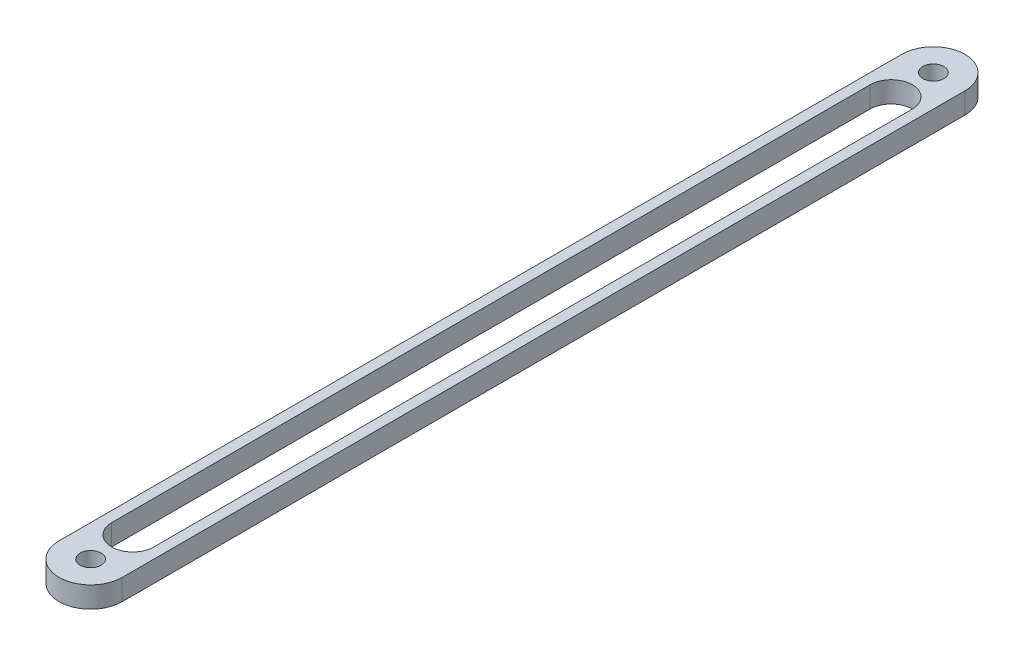
ISO-10303-21;
HEADER;
FILE_DESCRIPTION(('STEP AP214'),'2;1');
FILE_NAME('part.step','',(''),(''),'','','');
FILE_SCHEMA(('AUTOMOTIVE_DESIGN { 1 0 10303 214 1 1 1 1 }'));
ENDSEC;
DATA;
#1=APPLICATION_CONTEXT('core data for automotive mechanical design processes');
#2=APPLICATION_PROTOCOL_DEFINITION('international standard','automotive_design',2000,#1);
#3=PRODUCT_CONTEXT('',#1,'mechanical');
#4=PRODUCT('Part','Part','',(#3));
#5=PRODUCT_RELATED_PRODUCT_CATEGORY('part','',(#4));
#6=PRODUCT_DEFINITION_FORMATION('','',#4);
#7=PRODUCT_DEFINITION_CONTEXT('part definition',#1,'design');
#8=PRODUCT_DEFINITION('design','',#6,#7);
#9=PRODUCT_DEFINITION_SHAPE('','',#8);
#10=(LENGTH_UNIT() NAMED_UNIT(*) SI_UNIT(.MILLI.,.METRE.));
#11=(NAMED_UNIT(*) PLANE_ANGLE_UNIT() SI_UNIT($,.RADIAN.));
#12=(NAMED_UNIT(*) SI_UNIT($,.STERADIAN.) SOLID_ANGLE_UNIT());
#13=UNCERTAINTY_MEASURE_WITH_UNIT(LENGTH_MEASURE(1.E-05),#10,'distance_accuracy_value','');
#14=(GEOMETRIC_REPRESENTATION_CONTEXT(3) GLOBAL_UNCERTAINTY_ASSIGNED_CONTEXT((#13)) GLOBAL_UNIT_ASSIGNED_CONTEXT((#10,
#11,#12)) REPRESENTATION_CONTEXT('',''));
#15=CARTESIAN_POINT('',(0.,0.,0.));
#16=DIRECTION('',(0.,0.,1.));
#17=DIRECTION('',(1.,0.,0.));
#18=AXIS2_PLACEMENT_3D('',#15,#16,#17);
#19=CARTESIAN_POINT('',(3.75000000000001,2.5,0.));
#20=DIRECTION('',(0.,-1.,0.));
#21=DIRECTION('',(0.,0.,-1.));
#22=AXIS2_PLACEMENT_3D('',#19,#20,#21);
#23=PLANE('',#22);
#24=CARTESIAN_POINT('',(3.75000000000001,2.5,-95.));
#25=DIRECTION('',(0.,1.,0.));
#26=DIRECTION('',(0.,0.,-1.));
#27=AXIS2_PLACEMENT_3D('',#24,#25,#26);
#28=CIRCLE('',#27,2.50000000000001);
#29=CARTESIAN_POINT('',(6.25000000000001,2.5,-95.));
#30=VERTEX_POINT('',#29);
#31=CARTESIAN_POINT('',(1.25,2.5,-95.));
#32=VERTEX_POINT('',#31);
#33=EDGE_CURVE('E98',#30,#32,#28,.T.);
#34=ORIENTED_EDGE('',*,*,#33,.F.);
#35=DIRECTION('',(0.,0.,-1.));
#36=VECTOR('',#35,1.);
#37=CARTESIAN_POINT('',(6.25000000000001,2.5,-5.));
#38=LINE('',#37,#36);
#39=CARTESIAN_POINT('',(6.25000000000001,2.5,-5.));
#40=VERTEX_POINT('',#39);
#41=EDGE_CURVE('E121',#40,#30,#38,.T.);
#42=ORIENTED_EDGE('',*,*,#41,.F.);
#43=CARTESIAN_POINT('',(3.75000000000001,2.5,-5.));
#44=DIRECTION('',(0.,1.,0.));
#45=DIRECTION('',(0.,0.,1.));
#46=AXIS2_PLACEMENT_3D('',#43,#44,#45);
#47=CIRCLE('',#46,2.5);
#48=CARTESIAN_POINT('',(1.25000000000001,2.5,-5.));
#49=VERTEX_POINT('',#48);
#50=EDGE_CURVE('E119',#49,#40,#47,.T.);
#51=ORIENTED_EDGE('',*,*,#50,.F.);
#52=DIRECTION('',(0.,0.,1.));
#53=VECTOR('',#52,1.);
#54=CARTESIAN_POINT('',(1.25,2.5,-95.));
#55=LINE('',#54,#53);
#56=EDGE_CURVE('E106',#32,#49,#55,.T.);
#57=ORIENTED_EDGE('',*,*,#56,.F.);
#58=EDGE_LOOP('',(#34,#42,#51,#57));
#59=FACE_BOUND('',#58,.T.);
#60=CARTESIAN_POINT('',(3.75000000000001,2.5,0.));
#61=DIRECTION('',(0.,1.,0.));
#62=DIRECTION('',(0.,0.,-1.));
#63=AXIS2_PLACEMENT_3D('',#60,#61,#62);
#64=CIRCLE('',#63,3.75000000000001);
#65=CARTESIAN_POINT('',(0.,2.5,0.));
#66=VERTEX_POINT('',#65);
#67=CARTESIAN_POINT('',(7.50000000000001,2.5,0.));
#68=VERTEX_POINT('',#67);
#69=EDGE_CURVE('E143',#66,#68,#64,.T.);
#70=ORIENTED_EDGE('',*,*,#69,.T.);
#71=DIRECTION('',(0.,0.,-1.));
#72=VECTOR('',#71,1.);
#73=CARTESIAN_POINT('',(7.5,2.5,-100.));
#74=LINE('',#73,#72);
#75=CARTESIAN_POINT('',(7.5,2.5,-100.));
#76=VERTEX_POINT('',#75);
#77=EDGE_CURVE('E146',#68,#76,#74,.T.);
#78=ORIENTED_EDGE('',*,*,#77,.T.);
#79=CARTESIAN_POINT('',(3.75,2.5,-100.));
#80=DIRECTION('',(0.,1.,0.));
#81=DIRECTION('',(0.,0.,-1.));
#82=AXIS2_PLACEMENT_3D('',#79,#80,#81);
#83=CIRCLE('',#82,3.75);
#84=CARTESIAN_POINT('',(0.,2.5,-100.));
#85=VERTEX_POINT('',#84);
#86=EDGE_CURVE('E149',#76,#85,#83,.T.);
#87=ORIENTED_EDGE('',*,*,#86,.T.);
#88=DIRECTION('',(0.,0.,1.));
#89=VECTOR('',#88,1.);
#90=CARTESIAN_POINT('',(0.,2.5,0.));
#91=LINE('',#90,#89);
#92=EDGE_CURVE('E151',#85,#66,#91,.T.);
#93=ORIENTED_EDGE('',*,*,#92,.T.);
#94=EDGE_LOOP('',(#70,#78,#87,#93));
#95=FACE_BOUND('',#94,.T.);
#96=CARTESIAN_POINT('',(3.75000000000001,2.5,0.));
#97=DIRECTION('',(0.,1.,0.));
#98=DIRECTION('',(0.,0.,1.));
#99=AXIS2_PLACEMENT_3D('',#96,#97,#98);
#100=CIRCLE('',#99,1.25);
#101=CARTESIAN_POINT('',(3.75000000000001,2.5,1.25));
#102=VERTEX_POINT('',#101);
#103=EDGE_CURVE('E137',#102,#102,#100,.T.);
#104=ORIENTED_EDGE('',*,*,#103,.F.);
#105=EDGE_LOOP('',(#104));
#106=FACE_BOUND('',#105,.T.);
#107=CARTESIAN_POINT('',(3.75,2.5,-100.));
#108=DIRECTION('',(0.,1.,0.));
#109=DIRECTION('',(0.,0.,1.));
#110=AXIS2_PLACEMENT_3D('',#107,#108,#109);
#111=CIRCLE('',#110,1.25);
#112=CARTESIAN_POINT('',(3.75,2.5,-98.75));
#113=VERTEX_POINT('',#112);
#114=EDGE_CURVE('E127',#113,#113,#111,.T.);
#115=ORIENTED_EDGE('',*,*,#114,.F.);
#116=EDGE_LOOP('',(#115));
#117=FACE_BOUND('',#116,.T.);
#118=ADVANCED_FACE('F33',(#59,#95,#106,#117),#23,.F.);
#119=CARTESIAN_POINT('',(3.75000000000001,0.,0.));
#120=DIRECTION('',(0.,-1.,0.));
#121=DIRECTION('',(0.,0.,-1.));
#122=AXIS2_PLACEMENT_3D('',#119,#120,#121);
#123=PLANE('',#122);
#124=DIRECTION('',(0.,0.,-1.));
#125=VECTOR('',#124,1.);
#126=CARTESIAN_POINT('',(6.25000000000001,0.,-5.));
#127=LINE('',#126,#125);
#128=CARTESIAN_POINT('',(6.25000000000001,0.,-5.));
#129=VERTEX_POINT('',#128);
#130=CARTESIAN_POINT('',(6.25000000000001,0.,-95.));
#131=VERTEX_POINT('',#130);
#132=EDGE_CURVE('E107',#129,#131,#127,.T.);
#133=ORIENTED_EDGE('',*,*,#132,.T.);
#134=CARTESIAN_POINT('',(3.75000000000001,0.,-95.));
#135=DIRECTION('',(0.,1.,0.));
#136=DIRECTION('',(0.,0.,-1.));
#137=AXIS2_PLACEMENT_3D('',#134,#135,#136);
#138=CIRCLE('',#137,2.50000000000001);
#139=CARTESIAN_POINT('',(1.25,0.,-95.));
#140=VERTEX_POINT('',#139);
#141=EDGE_CURVE('E56',#131,#140,#138,.T.);
#142=ORIENTED_EDGE('',*,*,#141,.T.);
#143=DIRECTION('',(0.,0.,1.));
#144=VECTOR('',#143,1.);
#145=CARTESIAN_POINT('',(1.25,0.,-95.));
#146=LINE('',#145,#144);
#147=CARTESIAN_POINT('',(1.25000000000001,0.,-5.));
#148=VERTEX_POINT('',#147);
#149=EDGE_CURVE('E113',#140,#148,#146,.T.);
#150=ORIENTED_EDGE('',*,*,#149,.T.);
#151=CARTESIAN_POINT('',(3.75000000000001,0.,-5.));
#152=DIRECTION('',(0.,1.,0.));
#153=DIRECTION('',(0.,0.,1.));
#154=AXIS2_PLACEMENT_3D('',#151,#152,#153);
#155=CIRCLE('',#154,2.5);
#156=EDGE_CURVE('E129',#148,#129,#155,.T.);
#157=ORIENTED_EDGE('',*,*,#156,.T.);
#158=EDGE_LOOP('',(#133,#142,#150,#157));
#159=FACE_BOUND('',#158,.T.);
#160=CARTESIAN_POINT('',(3.75000000000001,0.,0.));
#161=DIRECTION('',(0.,1.,0.));
#162=DIRECTION('',(0.,0.,-1.));
#163=AXIS2_PLACEMENT_3D('',#160,#161,#162);
#164=CIRCLE('',#163,3.75000000000001);
#165=CARTESIAN_POINT('',(0.,0.,0.));
#166=VERTEX_POINT('',#165);
#167=CARTESIAN_POINT('',(7.50000000000001,0.,0.));
#168=VERTEX_POINT('',#167);
#169=EDGE_CURVE('E140',#166,#168,#164,.T.);
#170=ORIENTED_EDGE('',*,*,#169,.F.);
#171=DIRECTION('',(0.,0.,1.));
#172=VECTOR('',#171,1.);
#173=CARTESIAN_POINT('',(0.,0.,0.));
#174=LINE('',#173,#172);
#175=CARTESIAN_POINT('',(0.,0.,-100.));
#176=VERTEX_POINT('',#175);
#177=EDGE_CURVE('E147',#176,#166,#174,.T.);
#178=ORIENTED_EDGE('',*,*,#177,.F.);
#179=CARTESIAN_POINT('',(3.75,0.,-100.));
#180=DIRECTION('',(0.,1.,0.));
#181=DIRECTION('',(0.,0.,-1.));
#182=AXIS2_PLACEMENT_3D('',#179,#180,#181);
#183=CIRCLE('',#182,3.75);
#184=CARTESIAN_POINT('',(7.5,0.,-100.));
#185=VERTEX_POINT('',#184);
#186=EDGE_CURVE('E158',#185,#176,#183,.T.);
#187=ORIENTED_EDGE('',*,*,#186,.F.);
#188=DIRECTION('',(0.,0.,-1.));
#189=VECTOR('',#188,1.);
#190=CARTESIAN_POINT('',(7.5,0.,-100.));
#191=LINE('',#190,#189);
#192=EDGE_CURVE('E156',#168,#185,#191,.T.);
#193=ORIENTED_EDGE('',*,*,#192,.F.);
#194=EDGE_LOOP('',(#170,#178,#187,#193));
#195=FACE_BOUND('',#194,.T.);
#196=CARTESIAN_POINT('',(3.75000000000001,0.,0.));
#197=DIRECTION('',(0.,1.,0.));
#198=DIRECTION('',(0.,0.,1.));
#199=AXIS2_PLACEMENT_3D('',#196,#197,#198);
#200=CIRCLE('',#199,1.25);
#201=CARTESIAN_POINT('',(3.75000000000001,0.,1.25));
#202=VERTEX_POINT('',#201);
#203=EDGE_CURVE('E114',#202,#202,#200,.T.);
#204=ORIENTED_EDGE('',*,*,#203,.T.);
#205=EDGE_LOOP('',(#204));
#206=FACE_BOUND('',#205,.T.);
#207=CARTESIAN_POINT('',(3.75,0.,-100.));
#208=DIRECTION('',(0.,1.,0.));
#209=DIRECTION('',(0.,0.,1.));
#210=AXIS2_PLACEMENT_3D('',#207,#208,#209);
#211=CIRCLE('',#210,1.25);
#212=CARTESIAN_POINT('',(3.75,0.,-98.75));
#213=VERTEX_POINT('',#212);
#214=EDGE_CURVE('E218',#213,#213,#211,.T.);
#215=ORIENTED_EDGE('',*,*,#214,.T.);
#216=EDGE_LOOP('',(#215));
#217=FACE_BOUND('',#216,.T.);
#218=ADVANCED_FACE('F176',(#159,#195,#206,#217),#123,.T.);
#219=CARTESIAN_POINT('',(3.75000000000001,2.5,0.));
#220=DIRECTION('',(0.,-1.,0.));
#221=DIRECTION('',(0.,0.,-1.));
#222=AXIS2_PLACEMENT_3D('',#219,#220,#221);
#223=CYLINDRICAL_SURFACE('',#222,3.75000000000001);
#224=ORIENTED_EDGE('',*,*,#169,.T.);
#225=DIRECTION('',(0.,-1.,0.));
#226=VECTOR('',#225,1.);
#227=CARTESIAN_POINT('',(7.50000000000001,2.5,0.));
#228=LINE('',#227,#226);
#229=EDGE_CURVE('E11',#68,#168,#228,.T.);
#230=ORIENTED_EDGE('',*,*,#229,.F.);
#231=ORIENTED_EDGE('',*,*,#69,.F.);
#232=DIRECTION('',(0.,-1.,0.));
#233=VECTOR('',#232,1.);
#234=CARTESIAN_POINT('',(0.,2.5,0.));
#235=LINE('',#234,#233);
#236=EDGE_CURVE('E153',#66,#166,#235,.T.);
#237=ORIENTED_EDGE('',*,*,#236,.T.);
#238=EDGE_LOOP('',(#224,#230,#231,#237));
#239=FACE_BOUND('',#238,.T.);
#240=ADVANCED_FACE('F35',(#239),#223,.T.);
#241=CARTESIAN_POINT('',(7.5,2.5,-100.));
#242=DIRECTION('',(-1.,0.,0.));
#243=DIRECTION('',(0.,0.,1.));
#244=AXIS2_PLACEMENT_3D('',#241,#242,#243);
#245=PLANE('',#244);
#246=ORIENTED_EDGE('',*,*,#192,.T.);
#247=DIRECTION('',(0.,-1.,0.));
#248=VECTOR('',#247,1.);
#249=CARTESIAN_POINT('',(7.5,2.5,-100.));
#250=LINE('',#249,#248);
#251=EDGE_CURVE('E41',#76,#185,#250,.T.);
#252=ORIENTED_EDGE('',*,*,#251,.F.);
#253=ORIENTED_EDGE('',*,*,#77,.F.);
#254=ORIENTED_EDGE('',*,*,#229,.T.);
#255=EDGE_LOOP('',(#246,#252,#253,#254));
#256=FACE_BOUND('',#255,.T.);
#257=ADVANCED_FACE('F186',(#256),#245,.F.);
#258=CARTESIAN_POINT('',(3.75,2.5,-100.));
#259=DIRECTION('',(0.,-1.,0.));
#260=DIRECTION('',(0.,0.,-1.));
#261=AXIS2_PLACEMENT_3D('',#258,#259,#260);
#262=CYLINDRICAL_SURFACE('',#261,3.75);
#263=ORIENTED_EDGE('',*,*,#186,.T.);
#264=DIRECTION('',(0.,-1.,0.));
#265=VECTOR('',#264,1.);
#266=CARTESIAN_POINT('',(0.,2.5,-100.));
#267=LINE('',#266,#265);
#268=EDGE_CURVE('E163',#85,#176,#267,.T.);
#269=ORIENTED_EDGE('',*,*,#268,.F.);
#270=ORIENTED_EDGE('',*,*,#86,.F.);
#271=ORIENTED_EDGE('',*,*,#251,.T.);
#272=EDGE_LOOP('',(#263,#269,#270,#271));
#273=FACE_BOUND('',#272,.T.);
#274=ADVANCED_FACE('F170',(#273),#262,.T.);
#275=CARTESIAN_POINT('',(0.,2.5,0.));
#276=DIRECTION('',(1.,0.,0.));
#277=DIRECTION('',(0.,0.,-1.));
#278=AXIS2_PLACEMENT_3D('',#275,#276,#277);
#279=PLANE('',#278);
#280=ORIENTED_EDGE('',*,*,#177,.T.);
#281=ORIENTED_EDGE('',*,*,#236,.F.);
#282=ORIENTED_EDGE('',*,*,#92,.F.);
#283=ORIENTED_EDGE('',*,*,#268,.T.);
#284=EDGE_LOOP('',(#280,#281,#282,#283));
#285=FACE_BOUND('',#284,.T.);
#286=ADVANCED_FACE('F180',(#285),#279,.F.);
#287=CARTESIAN_POINT('',(3.75000000000001,2.5,0.));
#288=DIRECTION('',(0.,-1.,0.));
#289=DIRECTION('',(0.,0.,-1.));
#290=AXIS2_PLACEMENT_3D('',#287,#288,#289);
#291=CYLINDRICAL_SURFACE('',#290,1.25);
#292=ORIENTED_EDGE('',*,*,#103,.T.);
#293=EDGE_LOOP('',(#292));
#294=FACE_BOUND('',#293,.T.);
#295=ORIENTED_EDGE('',*,*,#203,.F.);
#296=EDGE_LOOP('',(#295));
#297=FACE_BOUND('',#296,.T.);
#298=ADVANCED_FACE('F201',(#294,#297),#291,.F.);
#299=CARTESIAN_POINT('',(3.75000000000001,2.5,-95.));
#300=DIRECTION('',(0.,-1.,0.));
#301=DIRECTION('',(0.,0.,-1.));
#302=AXIS2_PLACEMENT_3D('',#299,#300,#301);
#303=CYLINDRICAL_SURFACE('',#302,2.50000000000001);
#304=ORIENTED_EDGE('',*,*,#141,.F.);
#305=DIRECTION('',(0.,-1.,0.));
#306=VECTOR('',#305,1.);
#307=CARTESIAN_POINT('',(6.25000000000001,2.5,-95.));
#308=LINE('',#307,#306);
#309=EDGE_CURVE('E102',#30,#131,#308,.T.);
#310=ORIENTED_EDGE('',*,*,#309,.F.);
#311=ORIENTED_EDGE('',*,*,#33,.T.);
#312=DIRECTION('',(0.,-1.,0.));
#313=VECTOR('',#312,1.);
#314=CARTESIAN_POINT('',(1.25,2.5,-95.));
#315=LINE('',#314,#313);
#316=EDGE_CURVE('E101',#32,#140,#315,.T.);
#317=ORIENTED_EDGE('',*,*,#316,.T.);
#318=EDGE_LOOP('',(#304,#310,#311,#317));
#319=FACE_BOUND('',#318,.T.);
#320=ADVANCED_FACE('F100',(#319),#303,.F.);
#321=CARTESIAN_POINT('',(1.25,2.5,-95.));
#322=DIRECTION('',(1.,0.,0.));
#323=DIRECTION('',(0.,0.,-1.));
#324=AXIS2_PLACEMENT_3D('',#321,#322,#323);
#325=PLANE('',#324);
#326=ORIENTED_EDGE('',*,*,#149,.F.);
#327=ORIENTED_EDGE('',*,*,#316,.F.);
#328=ORIENTED_EDGE('',*,*,#56,.T.);
#329=DIRECTION('',(0.,-1.,0.));
#330=VECTOR('',#329,1.);
#331=CARTESIAN_POINT('',(1.25000000000001,2.5,-5.));
#332=LINE('',#331,#330);
#333=EDGE_CURVE('E115',#49,#148,#332,.T.);
#334=ORIENTED_EDGE('',*,*,#333,.T.);
#335=EDGE_LOOP('',(#326,#327,#328,#334));
#336=FACE_BOUND('',#335,.T.);
#337=ADVANCED_FACE('F110',(#336),#325,.T.);
#338=CARTESIAN_POINT('',(3.75000000000001,2.5,-5.));
#339=DIRECTION('',(0.,-1.,0.));
#340=DIRECTION('',(0.,0.,-1.));
#341=AXIS2_PLACEMENT_3D('',#338,#339,#340);
#342=CYLINDRICAL_SURFACE('',#341,2.5);
#343=ORIENTED_EDGE('',*,*,#156,.F.);
#344=ORIENTED_EDGE('',*,*,#333,.F.);
#345=ORIENTED_EDGE('',*,*,#50,.T.);
#346=DIRECTION('',(0.,-1.,0.));
#347=VECTOR('',#346,1.);
#348=CARTESIAN_POINT('',(6.25000000000001,2.5,-5.));
#349=LINE('',#348,#347);
#350=EDGE_CURVE('E48',#40,#129,#349,.T.);
#351=ORIENTED_EDGE('',*,*,#350,.T.);
#352=EDGE_LOOP('',(#343,#344,#345,#351));
#353=FACE_BOUND('',#352,.T.);
#354=ADVANCED_FACE('F232',(#353),#342,.F.);
#355=CARTESIAN_POINT('',(6.25000000000001,2.5,-5.));
#356=DIRECTION('',(-1.,0.,0.));
#357=DIRECTION('',(0.,0.,1.));
#358=AXIS2_PLACEMENT_3D('',#355,#356,#357);
#359=PLANE('',#358);
#360=ORIENTED_EDGE('',*,*,#132,.F.);
#361=ORIENTED_EDGE('',*,*,#350,.F.);
#362=ORIENTED_EDGE('',*,*,#41,.T.);
#363=ORIENTED_EDGE('',*,*,#309,.T.);
#364=EDGE_LOOP('',(#360,#361,#362,#363));
#365=FACE_BOUND('',#364,.T.);
#366=ADVANCED_FACE('F227',(#365),#359,.T.);
#367=CARTESIAN_POINT('',(3.75,2.5,-100.));
#368=DIRECTION('',(0.,-1.,0.));
#369=DIRECTION('',(0.,0.,-1.));
#370=AXIS2_PLACEMENT_3D('',#367,#368,#369);
#371=CYLINDRICAL_SURFACE('',#370,1.25);
#372=ORIENTED_EDGE('',*,*,#114,.T.);
#373=EDGE_LOOP('',(#372));
#374=FACE_BOUND('',#373,.T.);
#375=ORIENTED_EDGE('',*,*,#214,.F.);
#376=EDGE_LOOP('',(#375));
#377=FACE_BOUND('',#376,.T.);
#378=ADVANCED_FACE('F224',(#374,#377),#371,.F.);
#379=CLOSED_SHELL('',(#118,#218,#240,#257,#274,#286,#298,#320,#337,#354,#366,#378));
#380=MANIFOLD_SOLID_BREP('B2',#379);
#381=ADVANCED_BREP_SHAPE_REPRESENTATION('',(#18,#380),#14);
#382=SHAPE_DEFINITION_REPRESENTATION(#9,#381);
ENDSEC;
END-ISO-10303-21;
